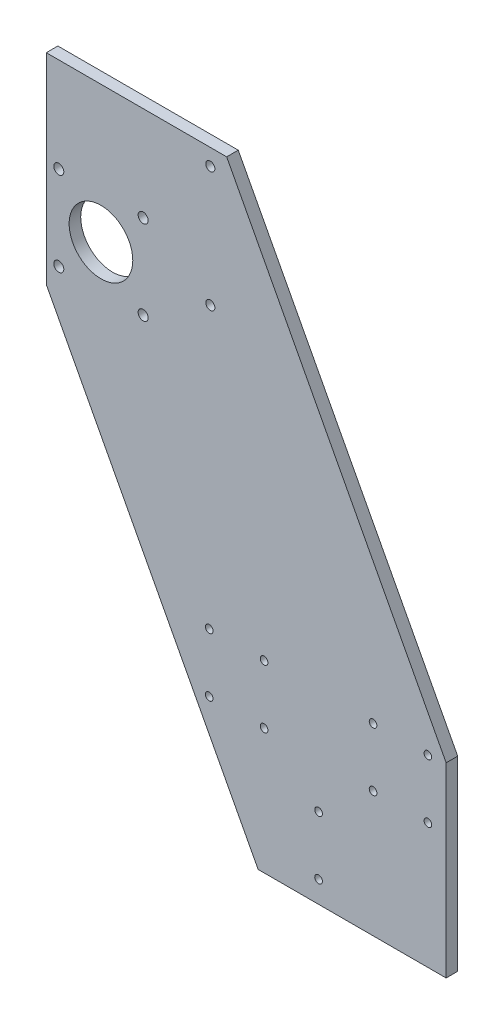
ISO-10303-21;
HEADER;
FILE_DESCRIPTION(('STEP AP214'),'2;1');
FILE_NAME('part.step','',(''),(''),'','','');
FILE_SCHEMA(('AUTOMOTIVE_DESIGN { 1 0 10303 214 1 1 1 1 }'));
ENDSEC;
DATA;
#1=APPLICATION_CONTEXT('core data for automotive mechanical design processes');
#2=APPLICATION_PROTOCOL_DEFINITION('international standard','automotive_design',2000,#1);
#3=PRODUCT_CONTEXT('',#1,'mechanical');
#4=PRODUCT('Part','Part','',(#3));
#5=PRODUCT_RELATED_PRODUCT_CATEGORY('part','',(#4));
#6=PRODUCT_DEFINITION_FORMATION('','',#4);
#7=PRODUCT_DEFINITION_CONTEXT('part definition',#1,'design');
#8=PRODUCT_DEFINITION('design','',#6,#7);
#9=PRODUCT_DEFINITION_SHAPE('','',#8);
#10=(LENGTH_UNIT() NAMED_UNIT(*) SI_UNIT(.MILLI.,.METRE.));
#11=(NAMED_UNIT(*) PLANE_ANGLE_UNIT() SI_UNIT($,.RADIAN.));
#12=(NAMED_UNIT(*) SI_UNIT($,.STERADIAN.) SOLID_ANGLE_UNIT());
#13=UNCERTAINTY_MEASURE_WITH_UNIT(LENGTH_MEASURE(1.E-05),#10,'distance_accuracy_value','');
#14=(GEOMETRIC_REPRESENTATION_CONTEXT(3) GLOBAL_UNCERTAINTY_ASSIGNED_CONTEXT((#13)) GLOBAL_UNIT_ASSIGNED_CONTEXT((#10,
#11,#12)) REPRESENTATION_CONTEXT('',''));
#15=CARTESIAN_POINT('',(0.,0.,0.));
#16=DIRECTION('',(0.,0.,1.));
#17=DIRECTION('',(1.,0.,0.));
#18=AXIS2_PLACEMENT_3D('',#15,#16,#17);
#19=CARTESIAN_POINT('',(0.,0.,6.35));
#20=DIRECTION('',(0.,0.,-1.));
#21=DIRECTION('',(-1.,0.,0.));
#22=AXIS2_PLACEMENT_3D('',#19,#20,#21);
#23=PLANE('',#22);
#24=CARTESIAN_POINT('',(-129.400809698569,301.142486270291,6.35));
#25=DIRECTION('',(0.,0.,1.));
#26=DIRECTION('',(1.,0.,0.));
#27=AXIS2_PLACEMENT_3D('',#24,#25,#26);
#28=CIRCLE('',#27,2.5);
#29=CARTESIAN_POINT('',(-126.900809698569,301.142486270291,6.35));
#30=VERTEX_POINT('',#29);
#31=EDGE_CURVE('E477',#30,#30,#28,.T.);
#32=ORIENTED_EDGE('',*,*,#31,.F.);
#33=EDGE_LOOP('',(#32));
#34=FACE_BOUND('',#33,.T.);
#35=CARTESIAN_POINT('',(-129.400809698569,235.142486270291,6.35));
#36=DIRECTION('',(0.,0.,1.));
#37=DIRECTION('',(1.,0.,0.));
#38=AXIS2_PLACEMENT_3D('',#35,#36,#37);
#39=CIRCLE('',#38,2.5);
#40=CARTESIAN_POINT('',(-126.900809698569,235.142486270291,6.35));
#41=VERTEX_POINT('',#40);
#42=EDGE_CURVE('E478',#41,#41,#39,.T.);
#43=ORIENTED_EDGE('',*,*,#42,.F.);
#44=EDGE_LOOP('',(#43));
#45=FACE_BOUND('',#44,.T.);
#46=CARTESIAN_POINT('',(-189.400809698569,235.142486270291,6.35));
#47=DIRECTION('',(0.,0.,1.));
#48=DIRECTION('',(1.,0.,0.));
#49=AXIS2_PLACEMENT_3D('',#46,#47,#48);
#50=CIRCLE('',#49,17.4625000000001);
#51=CARTESIAN_POINT('',(-171.938309698569,235.142486270291,6.35));
#52=VERTEX_POINT('',#51);
#53=EDGE_CURVE('E481',#52,#52,#50,.T.);
#54=ORIENTED_EDGE('',*,*,#53,.F.);
#55=EDGE_LOOP('',(#54));
#56=FACE_BOUND('',#55,.T.);
#57=CARTESIAN_POINT('',(-166.255809698569,258.287486270291,6.35));
#58=DIRECTION('',(0.,0.,1.));
#59=DIRECTION('',(-1.,0.,0.));
#60=AXIS2_PLACEMENT_3D('',#57,#58,#59);
#61=CIRCLE('',#60,2.75000000000001);
#62=CARTESIAN_POINT('',(-169.005809698569,258.287486270291,6.35));
#63=VERTEX_POINT('',#62);
#64=EDGE_CURVE('E494',#63,#63,#61,.T.);
#65=ORIENTED_EDGE('',*,*,#64,.F.);
#66=EDGE_LOOP('',(#65));
#67=FACE_BOUND('',#66,.T.);
#68=CARTESIAN_POINT('',(-166.255809698569,211.997486270291,6.35));
#69=DIRECTION('',(0.,0.,1.));
#70=DIRECTION('',(1.,0.,0.));
#71=AXIS2_PLACEMENT_3D('',#68,#69,#70);
#72=CIRCLE('',#71,2.75000000000001);
#73=CARTESIAN_POINT('',(-163.505809698569,211.997486270291,6.35));
#74=VERTEX_POINT('',#73);
#75=EDGE_CURVE('E489',#74,#74,#72,.T.);
#76=ORIENTED_EDGE('',*,*,#75,.F.);
#77=EDGE_LOOP('',(#76));
#78=FACE_BOUND('',#77,.T.);
#79=CARTESIAN_POINT('',(-212.545809698569,211.997486270291,6.35));
#80=DIRECTION('',(0.,0.,1.));
#81=DIRECTION('',(-1.,0.,0.));
#82=AXIS2_PLACEMENT_3D('',#79,#80,#81);
#83=CIRCLE('',#82,2.75000000000001);
#84=CARTESIAN_POINT('',(-215.295809698569,211.997486270291,6.35));
#85=VERTEX_POINT('',#84);
#86=EDGE_CURVE('E485',#85,#85,#83,.T.);
#87=ORIENTED_EDGE('',*,*,#86,.F.);
#88=EDGE_LOOP('',(#87));
#89=FACE_BOUND('',#88,.T.);
#90=CARTESIAN_POINT('',(-212.545809698569,258.287486270291,6.35));
#91=DIRECTION('',(0.,0.,1.));
#92=DIRECTION('',(1.,0.,0.));
#93=AXIS2_PLACEMENT_3D('',#90,#91,#92);
#94=CIRCLE('',#93,2.75000000000001);
#95=CARTESIAN_POINT('',(-209.795809698569,258.287486270291,6.35));
#96=VERTEX_POINT('',#95);
#97=EDGE_CURVE('E143',#96,#96,#94,.T.);
#98=ORIENTED_EDGE('',*,*,#97,.F.);
#99=EDGE_LOOP('',(#98));
#100=FACE_BOUND('',#99,.T.);
#101=DIRECTION('',(0.,1.,0.));
#102=VECTOR('',#101,1.);
#103=CARTESIAN_POINT('',(0.,0.,6.35));
#104=LINE('',#103,#102);
#105=CARTESIAN_POINT('',(0.,-19.8575137297087,6.35));
#106=VERTEX_POINT('',#105);
#107=CARTESIAN_POINT('',(0.,82.3898774843441,6.35));
#108=VERTEX_POINT('',#107);
#109=EDGE_CURVE('E91',#106,#108,#104,.T.);
#110=ORIENTED_EDGE('',*,*,#109,.T.);
#111=DIRECTION('',(-0.467423452268308,0.884033549289605,0.));
#112=VECTOR('',#111,1.);
#113=CARTESIAN_POINT('',(0.,82.3898774843441,6.35));
#114=LINE('',#113,#112);
#115=CARTESIAN_POINT('',(-120.421799316766,310.142486270291,6.35));
#116=VERTEX_POINT('',#115);
#117=EDGE_CURVE('E225',#108,#116,#114,.T.);
#118=ORIENTED_EDGE('',*,*,#117,.T.);
#119=DIRECTION('',(-1.,0.,0.));
#120=VECTOR('',#119,1.);
#121=CARTESIAN_POINT('',(-120.421799316766,310.142486270291,6.35));
#122=LINE('',#121,#120);
#123=CARTESIAN_POINT('',(-219.400809698569,310.142486270291,6.35));
#124=VERTEX_POINT('',#123);
#125=EDGE_CURVE('E105',#116,#124,#122,.T.);
#126=ORIENTED_EDGE('',*,*,#125,.T.);
#127=DIRECTION('',(0.,-1.,0.));
#128=VECTOR('',#127,1.);
#129=CARTESIAN_POINT('',(-219.400809698569,200.,6.35));
#130=LINE('',#129,#128);
#131=CARTESIAN_POINT('',(-219.400809698569,200.,6.35));
#132=VERTEX_POINT('',#131);
#133=EDGE_CURVE('E99',#124,#132,#130,.T.);
#134=ORIENTED_EDGE('',*,*,#133,.T.);
#135=DIRECTION('',(0.467423452268308,-0.884033549289605,0.));
#136=VECTOR('',#135,1.);
#137=CARTESIAN_POINT('',(-219.400809698569,200.,6.35));
#138=LINE('',#137,#136);
#139=CARTESIAN_POINT('',(-103.153458953511,-19.8575137297087,6.35));
#140=VERTEX_POINT('',#139);
#141=EDGE_CURVE('E103',#132,#140,#138,.T.);
#142=ORIENTED_EDGE('',*,*,#141,.T.);
#143=DIRECTION('',(1.,0.,0.));
#144=VECTOR('',#143,1.);
#145=CARTESIAN_POINT('',(0.,-19.8575137297087,6.35));
#146=LINE('',#145,#144);
#147=EDGE_CURVE('E55',#140,#106,#146,.T.);
#148=ORIENTED_EDGE('',*,*,#147,.T.);
#149=EDGE_LOOP('',(#110,#118,#126,#134,#142,#148));
#150=FACE_BOUND('',#149,.T.);
#151=CARTESIAN_POINT('',(-130.,81.05,6.35));
#152=DIRECTION('',(0.,0.,1.));
#153=DIRECTION('',(-1.,0.,0.));
#154=AXIS2_PLACEMENT_3D('',#151,#152,#153);
#155=CIRCLE('',#154,2.10000000000002);
#156=CARTESIAN_POINT('',(-132.1,81.05,6.35));
#157=VERTEX_POINT('',#156);
#158=EDGE_CURVE('E125',#157,#157,#155,.T.);
#159=ORIENTED_EDGE('',*,*,#158,.F.);
#160=EDGE_LOOP('',(#159));
#161=FACE_BOUND('',#160,.T.);
#162=CARTESIAN_POINT('',(-40.1,81.05,6.35));
#163=DIRECTION('',(0.,0.,1.));
#164=DIRECTION('',(1.,0.,0.));
#165=AXIS2_PLACEMENT_3D('',#162,#163,#164);
#166=CIRCLE('',#165,2.1);
#167=CARTESIAN_POINT('',(-38.,81.05,6.35));
#168=VERTEX_POINT('',#167);
#169=EDGE_CURVE('E214',#168,#168,#166,.T.);
#170=ORIENTED_EDGE('',*,*,#169,.F.);
#171=EDGE_LOOP('',(#170));
#172=FACE_BOUND('',#171,.T.);
#173=CARTESIAN_POINT('',(-10.,81.05,6.35));
#174=DIRECTION('',(0.,0.,1.));
#175=DIRECTION('',(1.,0.,0.));
#176=AXIS2_PLACEMENT_3D('',#173,#174,#175);
#177=CIRCLE('',#176,2.1);
#178=CARTESIAN_POINT('',(-7.9,81.05,6.35));
#179=VERTEX_POINT('',#178);
#180=EDGE_CURVE('E208',#179,#179,#177,.T.);
#181=ORIENTED_EDGE('',*,*,#180,.F.);
#182=EDGE_LOOP('',(#181));
#183=FACE_BOUND('',#182,.T.);
#184=CARTESIAN_POINT('',(-10.,48.95,6.35));
#185=DIRECTION('',(0.,0.,1.));
#186=DIRECTION('',(-1.,0.,0.));
#187=AXIS2_PLACEMENT_3D('',#184,#185,#186);
#188=CIRCLE('',#187,2.09999999999999);
#189=CARTESIAN_POINT('',(-12.1,48.95,6.35));
#190=VERTEX_POINT('',#189);
#191=EDGE_CURVE('E202',#190,#190,#188,.T.);
#192=ORIENTED_EDGE('',*,*,#191,.F.);
#193=EDGE_LOOP('',(#192));
#194=FACE_BOUND('',#193,.T.);
#195=CARTESIAN_POINT('',(-40.1,48.95,6.35));
#196=DIRECTION('',(0.,0.,1.));
#197=DIRECTION('',(-1.,0.,0.));
#198=AXIS2_PLACEMENT_3D('',#195,#196,#197);
#199=CIRCLE('',#198,2.1);
#200=CARTESIAN_POINT('',(-42.2,48.95,6.35));
#201=VERTEX_POINT('',#200);
#202=EDGE_CURVE('E196',#201,#201,#199,.T.);
#203=ORIENTED_EDGE('',*,*,#202,.F.);
#204=EDGE_LOOP('',(#203));
#205=FACE_BOUND('',#204,.T.);
#206=CARTESIAN_POINT('',(-99.9,81.05,6.35));
#207=DIRECTION('',(0.,0.,1.));
#208=DIRECTION('',(-1.,0.,0.));
#209=AXIS2_PLACEMENT_3D('',#206,#207,#208);
#210=CIRCLE('',#209,2.1);
#211=CARTESIAN_POINT('',(-102.,81.05,6.35));
#212=VERTEX_POINT('',#211);
#213=EDGE_CURVE('E190',#212,#212,#210,.T.);
#214=ORIENTED_EDGE('',*,*,#213,.F.);
#215=EDGE_LOOP('',(#214));
#216=FACE_BOUND('',#215,.T.);
#217=CARTESIAN_POINT('',(-99.9,48.95,6.35));
#218=DIRECTION('',(0.,0.,1.));
#219=DIRECTION('',(1.,0.,0.));
#220=AXIS2_PLACEMENT_3D('',#217,#218,#219);
#221=CIRCLE('',#220,2.09999999999999);
#222=CARTESIAN_POINT('',(-97.8,48.95,6.35));
#223=VERTEX_POINT('',#222);
#224=EDGE_CURVE('E184',#223,#223,#221,.T.);
#225=ORIENTED_EDGE('',*,*,#224,.F.);
#226=EDGE_LOOP('',(#225));
#227=FACE_BOUND('',#226,.T.);
#228=CARTESIAN_POINT('',(-130.,48.95,6.35));
#229=DIRECTION('',(0.,0.,1.));
#230=DIRECTION('',(1.,0.,0.));
#231=AXIS2_PLACEMENT_3D('',#228,#229,#230);
#232=CIRCLE('',#231,2.10000000000002);
#233=CARTESIAN_POINT('',(-127.9,48.95,6.35));
#234=VERTEX_POINT('',#233);
#235=EDGE_CURVE('E178',#234,#234,#232,.T.);
#236=ORIENTED_EDGE('',*,*,#235,.F.);
#237=EDGE_LOOP('',(#236));
#238=FACE_BOUND('',#237,.T.);
#239=CARTESIAN_POINT('',(-70.,24.15,6.35));
#240=DIRECTION('',(0.,0.,1.));
#241=DIRECTION('',(-1.,0.,0.));
#242=AXIS2_PLACEMENT_3D('',#239,#240,#241);
#243=CIRCLE('',#242,2.1);
#244=CARTESIAN_POINT('',(-72.1,24.15,6.35));
#245=VERTEX_POINT('',#244);
#246=EDGE_CURVE('E172',#245,#245,#243,.T.);
#247=ORIENTED_EDGE('',*,*,#246,.F.);
#248=EDGE_LOOP('',(#247));
#249=FACE_BOUND('',#248,.T.);
#250=CARTESIAN_POINT('',(-70.,-7.95000000000001,6.35));
#251=DIRECTION('',(0.,0.,1.));
#252=DIRECTION('',(1.,0.,0.));
#253=AXIS2_PLACEMENT_3D('',#250,#251,#252);
#254=CIRCLE('',#253,2.09999999999999);
#255=CARTESIAN_POINT('',(-67.9,-7.95000000000001,6.35));
#256=VERTEX_POINT('',#255);
#257=EDGE_CURVE('E163',#256,#256,#254,.T.);
#258=ORIENTED_EDGE('',*,*,#257,.F.);
#259=EDGE_LOOP('',(#258));
#260=FACE_BOUND('',#259,.T.);
#261=ADVANCED_FACE('F36',(#34,#45,#56,#67,#78,#89,#100,#150,#161,#172,#183,#194,#205,#216,#227,
#238,#249,#260),#23,.F.);
#262=CARTESIAN_POINT('',(0.,0.,0.));
#263=DIRECTION('',(0.,0.,-1.));
#264=DIRECTION('',(-1.,0.,0.));
#265=AXIS2_PLACEMENT_3D('',#262,#263,#264);
#266=PLANE('',#265);
#267=CARTESIAN_POINT('',(-129.400809698569,301.142486270291,0.));
#268=DIRECTION('',(0.,0.,-1.));
#269=DIRECTION('',(-1.,0.,0.));
#270=AXIS2_PLACEMENT_3D('',#267,#268,#269);
#271=CIRCLE('',#270,2.5);
#272=CARTESIAN_POINT('',(-131.900809698569,301.142486270291,0.));
#273=VERTEX_POINT('',#272);
#274=EDGE_CURVE('E40',#273,#273,#271,.T.);
#275=ORIENTED_EDGE('',*,*,#274,.F.);
#276=EDGE_LOOP('',(#275));
#277=FACE_BOUND('',#276,.T.);
#278=CARTESIAN_POINT('',(-129.400809698569,235.142486270291,0.));
#279=DIRECTION('',(0.,0.,-1.));
#280=DIRECTION('',(-1.,0.,0.));
#281=AXIS2_PLACEMENT_3D('',#278,#279,#280);
#282=CIRCLE('',#281,2.5);
#283=CARTESIAN_POINT('',(-131.900809698569,235.142486270291,0.));
#284=VERTEX_POINT('',#283);
#285=EDGE_CURVE('E154',#284,#284,#282,.T.);
#286=ORIENTED_EDGE('',*,*,#285,.F.);
#287=EDGE_LOOP('',(#286));
#288=FACE_BOUND('',#287,.T.);
#289=CARTESIAN_POINT('',(-189.400809698569,235.142486270291,0.));
#290=DIRECTION('',(0.,0.,-1.));
#291=DIRECTION('',(-1.,0.,0.));
#292=AXIS2_PLACEMENT_3D('',#289,#290,#291);
#293=CIRCLE('',#292,17.4625000000001);
#294=CARTESIAN_POINT('',(-206.863309698569,235.142486270291,0.));
#295=VERTEX_POINT('',#294);
#296=EDGE_CURVE('E152',#295,#295,#293,.T.);
#297=ORIENTED_EDGE('',*,*,#296,.F.);
#298=EDGE_LOOP('',(#297));
#299=FACE_BOUND('',#298,.T.);
#300=CARTESIAN_POINT('',(-166.255809698569,258.287486270291,0.));
#301=DIRECTION('',(0.,0.,-1.));
#302=DIRECTION('',(-1.,0.,0.));
#303=AXIS2_PLACEMENT_3D('',#300,#301,#302);
#304=CIRCLE('',#303,2.75000000000001);
#305=CARTESIAN_POINT('',(-169.005809698569,258.287486270291,0.));
#306=VERTEX_POINT('',#305);
#307=EDGE_CURVE('E149',#306,#306,#304,.T.);
#308=ORIENTED_EDGE('',*,*,#307,.F.);
#309=EDGE_LOOP('',(#308));
#310=FACE_BOUND('',#309,.T.);
#311=CARTESIAN_POINT('',(-166.255809698569,211.997486270291,0.));
#312=DIRECTION('',(0.,0.,-1.));
#313=DIRECTION('',(-1.,0.,0.));
#314=AXIS2_PLACEMENT_3D('',#311,#312,#313);
#315=CIRCLE('',#314,2.75000000000001);
#316=CARTESIAN_POINT('',(-169.005809698569,211.997486270291,0.));
#317=VERTEX_POINT('',#316);
#318=EDGE_CURVE('E146',#317,#317,#315,.T.);
#319=ORIENTED_EDGE('',*,*,#318,.F.);
#320=EDGE_LOOP('',(#319));
#321=FACE_BOUND('',#320,.T.);
#322=CARTESIAN_POINT('',(-212.545809698569,211.997486270291,0.));
#323=DIRECTION('',(0.,0.,-1.));
#324=DIRECTION('',(-1.,0.,0.));
#325=AXIS2_PLACEMENT_3D('',#322,#323,#324);
#326=CIRCLE('',#325,2.75000000000001);
#327=CARTESIAN_POINT('',(-215.295809698569,211.997486270291,0.));
#328=VERTEX_POINT('',#327);
#329=EDGE_CURVE('E142',#328,#328,#326,.T.);
#330=ORIENTED_EDGE('',*,*,#329,.F.);
#331=EDGE_LOOP('',(#330));
#332=FACE_BOUND('',#331,.T.);
#333=CARTESIAN_POINT('',(-212.545809698569,258.287486270291,0.));
#334=DIRECTION('',(0.,0.,-1.));
#335=DIRECTION('',(-1.,0.,0.));
#336=AXIS2_PLACEMENT_3D('',#333,#334,#335);
#337=CIRCLE('',#336,2.75000000000001);
#338=CARTESIAN_POINT('',(-215.295809698569,258.287486270291,0.));
#339=VERTEX_POINT('',#338);
#340=EDGE_CURVE('E139',#339,#339,#337,.T.);
#341=ORIENTED_EDGE('',*,*,#340,.F.);
#342=EDGE_LOOP('',(#341));
#343=FACE_BOUND('',#342,.T.);
#344=CARTESIAN_POINT('',(-70.,24.15,0.));
#345=DIRECTION('',(0.,0.,1.));
#346=DIRECTION('',(-1.,0.,0.));
#347=AXIS2_PLACEMENT_3D('',#344,#345,#346);
#348=CIRCLE('',#347,2.1);
#349=CARTESIAN_POINT('',(-72.1,24.15,0.));
#350=VERTEX_POINT('',#349);
#351=EDGE_CURVE('E168',#350,#350,#348,.T.);
#352=ORIENTED_EDGE('',*,*,#351,.T.);
#353=EDGE_LOOP('',(#352));
#354=FACE_BOUND('',#353,.T.);
#355=CARTESIAN_POINT('',(-99.9,48.95,0.));
#356=DIRECTION('',(0.,0.,1.));
#357=DIRECTION('',(1.,0.,0.));
#358=AXIS2_PLACEMENT_3D('',#355,#356,#357);
#359=CIRCLE('',#358,2.09999999999999);
#360=CARTESIAN_POINT('',(-97.8,48.95,0.));
#361=VERTEX_POINT('',#360);
#362=EDGE_CURVE('E181',#361,#361,#359,.T.);
#363=ORIENTED_EDGE('',*,*,#362,.T.);
#364=EDGE_LOOP('',(#363));
#365=FACE_BOUND('',#364,.T.);
#366=CARTESIAN_POINT('',(-40.1,48.95,0.));
#367=DIRECTION('',(0.,0.,1.));
#368=DIRECTION('',(-1.,0.,0.));
#369=AXIS2_PLACEMENT_3D('',#366,#367,#368);
#370=CIRCLE('',#369,2.1);
#371=CARTESIAN_POINT('',(-42.2,48.95,0.));
#372=VERTEX_POINT('',#371);
#373=EDGE_CURVE('E193',#372,#372,#370,.T.);
#374=ORIENTED_EDGE('',*,*,#373,.T.);
#375=EDGE_LOOP('',(#374));
#376=FACE_BOUND('',#375,.T.);
#377=CARTESIAN_POINT('',(-10.,81.05,0.));
#378=DIRECTION('',(0.,0.,1.));
#379=DIRECTION('',(1.,0.,0.));
#380=AXIS2_PLACEMENT_3D('',#377,#378,#379);
#381=CIRCLE('',#380,2.1);
#382=CARTESIAN_POINT('',(-7.9,81.05,0.));
#383=VERTEX_POINT('',#382);
#384=EDGE_CURVE('E205',#383,#383,#381,.T.);
#385=ORIENTED_EDGE('',*,*,#384,.T.);
#386=EDGE_LOOP('',(#385));
#387=FACE_BOUND('',#386,.T.);
#388=CARTESIAN_POINT('',(-130.,81.05,0.));
#389=DIRECTION('',(0.,0.,1.));
#390=DIRECTION('',(-1.,0.,0.));
#391=AXIS2_PLACEMENT_3D('',#388,#389,#390);
#392=CIRCLE('',#391,2.10000000000002);
#393=CARTESIAN_POINT('',(-132.1,81.05,0.));
#394=VERTEX_POINT('',#393);
#395=EDGE_CURVE('E217',#394,#394,#392,.T.);
#396=ORIENTED_EDGE('',*,*,#395,.T.);
#397=EDGE_LOOP('',(#396));
#398=FACE_BOUND('',#397,.T.);
#399=DIRECTION('',(0.,1.,0.));
#400=VECTOR('',#399,1.);
#401=CARTESIAN_POINT('',(0.,0.,0.));
#402=LINE('',#401,#400);
#403=CARTESIAN_POINT('',(0.,-19.8575137297087,0.));
#404=VERTEX_POINT('',#403);
#405=CARTESIAN_POINT('',(0.,82.3898774843441,0.));
#406=VERTEX_POINT('',#405);
#407=EDGE_CURVE('E85',#404,#406,#402,.T.);
#408=ORIENTED_EDGE('',*,*,#407,.F.);
#409=DIRECTION('',(1.,0.,0.));
#410=VECTOR('',#409,1.);
#411=CARTESIAN_POINT('',(0.,-19.8575137297087,0.));
#412=LINE('',#411,#410);
#413=CARTESIAN_POINT('',(-103.153458953511,-19.8575137297087,0.));
#414=VERTEX_POINT('',#413);
#415=EDGE_CURVE('E131',#414,#404,#412,.T.);
#416=ORIENTED_EDGE('',*,*,#415,.F.);
#417=DIRECTION('',(0.467423452268308,-0.884033549289605,0.));
#418=VECTOR('',#417,1.);
#419=CARTESIAN_POINT('',(-219.400809698569,200.,0.));
#420=LINE('',#419,#418);
#421=CARTESIAN_POINT('',(-219.400809698569,200.,0.));
#422=VERTEX_POINT('',#421);
#423=EDGE_CURVE('E78',#422,#414,#420,.T.);
#424=ORIENTED_EDGE('',*,*,#423,.F.);
#425=DIRECTION('',(0.,-1.,0.));
#426=VECTOR('',#425,1.);
#427=CARTESIAN_POINT('',(-219.400809698569,200.,0.));
#428=LINE('',#427,#426);
#429=CARTESIAN_POINT('',(-219.400809698569,310.142486270291,0.));
#430=VERTEX_POINT('',#429);
#431=EDGE_CURVE('E113',#430,#422,#428,.T.);
#432=ORIENTED_EDGE('',*,*,#431,.F.);
#433=DIRECTION('',(-1.,0.,0.));
#434=VECTOR('',#433,1.);
#435=CARTESIAN_POINT('',(-120.421799316766,310.142486270291,0.));
#436=LINE('',#435,#434);
#437=CARTESIAN_POINT('',(-120.421799316766,310.142486270291,0.));
#438=VERTEX_POINT('',#437);
#439=EDGE_CURVE('E127',#438,#430,#436,.T.);
#440=ORIENTED_EDGE('',*,*,#439,.F.);
#441=DIRECTION('',(-0.467423452268308,0.884033549289605,0.));
#442=VECTOR('',#441,1.);
#443=CARTESIAN_POINT('',(0.,82.3898774843441,0.));
#444=LINE('',#443,#442);
#445=EDGE_CURVE('E124',#406,#438,#444,.T.);
#446=ORIENTED_EDGE('',*,*,#445,.F.);
#447=EDGE_LOOP('',(#408,#416,#424,#432,#440,#446));
#448=FACE_BOUND('',#447,.T.);
#449=CARTESIAN_POINT('',(-40.1,81.05,0.));
#450=DIRECTION('',(0.,0.,1.));
#451=DIRECTION('',(1.,0.,0.));
#452=AXIS2_PLACEMENT_3D('',#449,#450,#451);
#453=CIRCLE('',#452,2.1);
#454=CARTESIAN_POINT('',(-38.,81.05,0.));
#455=VERTEX_POINT('',#454);
#456=EDGE_CURVE('E211',#455,#455,#453,.T.);
#457=ORIENTED_EDGE('',*,*,#456,.T.);
#458=EDGE_LOOP('',(#457));
#459=FACE_BOUND('',#458,.T.);
#460=CARTESIAN_POINT('',(-10.,48.95,0.));
#461=DIRECTION('',(0.,0.,1.));
#462=DIRECTION('',(-1.,0.,0.));
#463=AXIS2_PLACEMENT_3D('',#460,#461,#462);
#464=CIRCLE('',#463,2.09999999999999);
#465=CARTESIAN_POINT('',(-12.1,48.95,0.));
#466=VERTEX_POINT('',#465);
#467=EDGE_CURVE('E199',#466,#466,#464,.T.);
#468=ORIENTED_EDGE('',*,*,#467,.T.);
#469=EDGE_LOOP('',(#468));
#470=FACE_BOUND('',#469,.T.);
#471=CARTESIAN_POINT('',(-99.9,81.05,0.));
#472=DIRECTION('',(0.,0.,1.));
#473=DIRECTION('',(-1.,0.,0.));
#474=AXIS2_PLACEMENT_3D('',#471,#472,#473);
#475=CIRCLE('',#474,2.1);
#476=CARTESIAN_POINT('',(-102.,81.05,0.));
#477=VERTEX_POINT('',#476);
#478=EDGE_CURVE('E187',#477,#477,#475,.T.);
#479=ORIENTED_EDGE('',*,*,#478,.T.);
#480=EDGE_LOOP('',(#479));
#481=FACE_BOUND('',#480,.T.);
#482=CARTESIAN_POINT('',(-130.,48.95,0.));
#483=DIRECTION('',(0.,0.,1.));
#484=DIRECTION('',(1.,0.,0.));
#485=AXIS2_PLACEMENT_3D('',#482,#483,#484);
#486=CIRCLE('',#485,2.10000000000002);
#487=CARTESIAN_POINT('',(-127.9,48.95,0.));
#488=VERTEX_POINT('',#487);
#489=EDGE_CURVE('E175',#488,#488,#486,.T.);
#490=ORIENTED_EDGE('',*,*,#489,.T.);
#491=EDGE_LOOP('',(#490));
#492=FACE_BOUND('',#491,.T.);
#493=CARTESIAN_POINT('',(-70.,-7.95000000000001,0.));
#494=DIRECTION('',(0.,0.,1.));
#495=DIRECTION('',(1.,0.,0.));
#496=AXIS2_PLACEMENT_3D('',#493,#494,#495);
#497=CIRCLE('',#496,2.09999999999999);
#498=CARTESIAN_POINT('',(-67.9,-7.95000000000001,0.));
#499=VERTEX_POINT('',#498);
#500=EDGE_CURVE('E159',#499,#499,#497,.T.);
#501=ORIENTED_EDGE('',*,*,#500,.T.);
#502=EDGE_LOOP('',(#501));
#503=FACE_BOUND('',#502,.T.);
#504=ADVANCED_FACE('F233',(#277,#288,#299,#310,#321,#332,#343,#354,#365,#376,#387,#398,#448,
#459,#470,#481,#492,#503),#266,.T.);
#505=CARTESIAN_POINT('',(0.,0.,6.35));
#506=DIRECTION('',(-1.,0.,0.));
#507=DIRECTION('',(0.,-1.,0.));
#508=AXIS2_PLACEMENT_3D('',#505,#506,#507);
#509=PLANE('',#508);
#510=ORIENTED_EDGE('',*,*,#407,.T.);
#511=DIRECTION('',(0.,0.,-1.));
#512=VECTOR('',#511,1.);
#513=CARTESIAN_POINT('',(0.,82.3898774843441,6.35));
#514=LINE('',#513,#512);
#515=EDGE_CURVE('E11',#108,#406,#514,.T.);
#516=ORIENTED_EDGE('',*,*,#515,.F.);
#517=ORIENTED_EDGE('',*,*,#109,.F.);
#518=DIRECTION('',(0.,0.,-1.));
#519=VECTOR('',#518,1.);
#520=CARTESIAN_POINT('',(0.,-19.8575137297087,6.35));
#521=LINE('',#520,#519);
#522=EDGE_CURVE('E119',#106,#404,#521,.T.);
#523=ORIENTED_EDGE('',*,*,#522,.T.);
#524=EDGE_LOOP('',(#510,#516,#517,#523));
#525=FACE_BOUND('',#524,.T.);
#526=ADVANCED_FACE('F38',(#525),#509,.F.);
#527=CARTESIAN_POINT('',(0.,82.3898774843441,6.35));
#528=DIRECTION('',(-0.884033549289605,-0.467423452268308,0.));
#529=DIRECTION('',(0.467423452268308,-0.884033549289605,0.));
#530=AXIS2_PLACEMENT_3D('',#527,#528,#529);
#531=PLANE('',#530);
#532=ORIENTED_EDGE('',*,*,#445,.T.);
#533=DIRECTION('',(0.,0.,-1.));
#534=VECTOR('',#533,1.);
#535=CARTESIAN_POINT('',(-120.421799316766,310.142486270291,6.35));
#536=LINE('',#535,#534);
#537=EDGE_CURVE('E46',#116,#438,#536,.T.);
#538=ORIENTED_EDGE('',*,*,#537,.F.);
#539=ORIENTED_EDGE('',*,*,#117,.F.);
#540=ORIENTED_EDGE('',*,*,#515,.T.);
#541=EDGE_LOOP('',(#532,#538,#539,#540));
#542=FACE_BOUND('',#541,.T.);
#543=ADVANCED_FACE('F229',(#542),#531,.F.);
#544=CARTESIAN_POINT('',(-120.421799316766,310.142486270291,6.35));
#545=DIRECTION('',(0.,-1.,0.));
#546=DIRECTION('',(0.,0.,-1.));
#547=AXIS2_PLACEMENT_3D('',#544,#545,#546);
#548=PLANE('',#547);
#549=ORIENTED_EDGE('',*,*,#439,.T.);
#550=DIRECTION('',(0.,0.,-1.));
#551=VECTOR('',#550,1.);
#552=CARTESIAN_POINT('',(-219.400809698569,310.142486270291,6.35));
#553=LINE('',#552,#551);
#554=EDGE_CURVE('E114',#124,#430,#553,.T.);
#555=ORIENTED_EDGE('',*,*,#554,.F.);
#556=ORIENTED_EDGE('',*,*,#125,.F.);
#557=ORIENTED_EDGE('',*,*,#537,.T.);
#558=EDGE_LOOP('',(#549,#555,#556,#557));
#559=FACE_BOUND('',#558,.T.);
#560=ADVANCED_FACE('F232',(#559),#548,.F.);
#561=CARTESIAN_POINT('',(-219.400809698569,200.,6.35));
#562=DIRECTION('',(1.,0.,0.));
#563=DIRECTION('',(0.,0.,-1.));
#564=AXIS2_PLACEMENT_3D('',#561,#562,#563);
#565=PLANE('',#564);
#566=ORIENTED_EDGE('',*,*,#431,.T.);
#567=DIRECTION('',(0.,0.,-1.));
#568=VECTOR('',#567,1.);
#569=CARTESIAN_POINT('',(-219.400809698569,200.,6.35));
#570=LINE('',#569,#568);
#571=EDGE_CURVE('E110',#132,#422,#570,.T.);
#572=ORIENTED_EDGE('',*,*,#571,.F.);
#573=ORIENTED_EDGE('',*,*,#133,.F.);
#574=ORIENTED_EDGE('',*,*,#554,.T.);
#575=EDGE_LOOP('',(#566,#572,#573,#574));
#576=FACE_BOUND('',#575,.T.);
#577=ADVANCED_FACE('F111',(#576),#565,.F.);
#578=CARTESIAN_POINT('',(-219.400809698569,200.,6.35));
#579=DIRECTION('',(0.884033549289605,0.467423452268308,0.));
#580=DIRECTION('',(-0.467423452268308,0.884033549289605,0.));
#581=AXIS2_PLACEMENT_3D('',#578,#579,#580);
#582=PLANE('',#581);
#583=ORIENTED_EDGE('',*,*,#423,.T.);
#584=DIRECTION('',(0.,0.,-1.));
#585=VECTOR('',#584,1.);
#586=CARTESIAN_POINT('',(-103.153458953511,-19.8575137297087,6.35));
#587=LINE('',#586,#585);
#588=EDGE_CURVE('E115',#140,#414,#587,.T.);
#589=ORIENTED_EDGE('',*,*,#588,.F.);
#590=ORIENTED_EDGE('',*,*,#141,.F.);
#591=ORIENTED_EDGE('',*,*,#571,.T.);
#592=EDGE_LOOP('',(#583,#589,#590,#591));
#593=FACE_BOUND('',#592,.T.);
#594=ADVANCED_FACE('F117',(#593),#582,.F.);
#595=CARTESIAN_POINT('',(0.,-19.8575137297087,6.35));
#596=DIRECTION('',(0.,1.,0.));
#597=DIRECTION('',(-1.,0.,0.));
#598=AXIS2_PLACEMENT_3D('',#595,#596,#597);
#599=PLANE('',#598);
#600=ORIENTED_EDGE('',*,*,#415,.T.);
#601=ORIENTED_EDGE('',*,*,#522,.F.);
#602=ORIENTED_EDGE('',*,*,#147,.F.);
#603=ORIENTED_EDGE('',*,*,#588,.T.);
#604=EDGE_LOOP('',(#600,#601,#602,#603));
#605=FACE_BOUND('',#604,.T.);
#606=ADVANCED_FACE('F236',(#605),#599,.F.);
#607=CARTESIAN_POINT('',(-130.,81.05,6.35));
#608=DIRECTION('',(0.,0.,-1.));
#609=DIRECTION('',(-1.,0.,0.));
#610=AXIS2_PLACEMENT_3D('',#607,#608,#609);
#611=CYLINDRICAL_SURFACE('',#610,2.10000000000002);
#612=ORIENTED_EDGE('',*,*,#158,.T.);
#613=EDGE_LOOP('',(#612));
#614=FACE_BOUND('',#613,.T.);
#615=ORIENTED_EDGE('',*,*,#395,.F.);
#616=EDGE_LOOP('',(#615));
#617=FACE_BOUND('',#616,.T.);
#618=ADVANCED_FACE('F253',(#614,#617),#611,.F.);
#619=CARTESIAN_POINT('',(-40.1,81.05,6.35));
#620=DIRECTION('',(0.,0.,-1.));
#621=DIRECTION('',(-1.,0.,0.));
#622=AXIS2_PLACEMENT_3D('',#619,#620,#621);
#623=CYLINDRICAL_SURFACE('',#622,2.1);
#624=ORIENTED_EDGE('',*,*,#169,.T.);
#625=EDGE_LOOP('',(#624));
#626=FACE_BOUND('',#625,.T.);
#627=ORIENTED_EDGE('',*,*,#456,.F.);
#628=EDGE_LOOP('',(#627));
#629=FACE_BOUND('',#628,.T.);
#630=ADVANCED_FACE('F285',(#626,#629),#623,.F.);
#631=CARTESIAN_POINT('',(-10.,81.05,6.35));
#632=DIRECTION('',(0.,0.,-1.));
#633=DIRECTION('',(-1.,0.,0.));
#634=AXIS2_PLACEMENT_3D('',#631,#632,#633);
#635=CYLINDRICAL_SURFACE('',#634,2.1);
#636=ORIENTED_EDGE('',*,*,#180,.T.);
#637=EDGE_LOOP('',(#636));
#638=FACE_BOUND('',#637,.T.);
#639=ORIENTED_EDGE('',*,*,#384,.F.);
#640=EDGE_LOOP('',(#639));
#641=FACE_BOUND('',#640,.T.);
#642=ADVANCED_FACE('F292',(#638,#641),#635,.F.);
#643=CARTESIAN_POINT('',(-10.,48.95,6.35));
#644=DIRECTION('',(0.,0.,-1.));
#645=DIRECTION('',(-1.,0.,0.));
#646=AXIS2_PLACEMENT_3D('',#643,#644,#645);
#647=CYLINDRICAL_SURFACE('',#646,2.09999999999999);
#648=ORIENTED_EDGE('',*,*,#191,.T.);
#649=EDGE_LOOP('',(#648));
#650=FACE_BOUND('',#649,.T.);
#651=ORIENTED_EDGE('',*,*,#467,.F.);
#652=EDGE_LOOP('',(#651));
#653=FACE_BOUND('',#652,.T.);
#654=ADVANCED_FACE('F299',(#650,#653),#647,.F.);
#655=CARTESIAN_POINT('',(-40.1,48.95,6.35));
#656=DIRECTION('',(0.,0.,-1.));
#657=DIRECTION('',(-1.,0.,0.));
#658=AXIS2_PLACEMENT_3D('',#655,#656,#657);
#659=CYLINDRICAL_SURFACE('',#658,2.1);
#660=ORIENTED_EDGE('',*,*,#202,.T.);
#661=EDGE_LOOP('',(#660));
#662=FACE_BOUND('',#661,.T.);
#663=ORIENTED_EDGE('',*,*,#373,.F.);
#664=EDGE_LOOP('',(#663));
#665=FACE_BOUND('',#664,.T.);
#666=ADVANCED_FACE('F307',(#662,#665),#659,.F.);
#667=CARTESIAN_POINT('',(-99.9,81.05,6.35));
#668=DIRECTION('',(0.,0.,-1.));
#669=DIRECTION('',(-1.,0.,0.));
#670=AXIS2_PLACEMENT_3D('',#667,#668,#669);
#671=CYLINDRICAL_SURFACE('',#670,2.1);
#672=ORIENTED_EDGE('',*,*,#213,.T.);
#673=EDGE_LOOP('',(#672));
#674=FACE_BOUND('',#673,.T.);
#675=ORIENTED_EDGE('',*,*,#478,.F.);
#676=EDGE_LOOP('',(#675));
#677=FACE_BOUND('',#676,.T.);
#678=ADVANCED_FACE('F315',(#674,#677),#671,.F.);
#679=CARTESIAN_POINT('',(-99.9,48.95,6.35));
#680=DIRECTION('',(0.,0.,-1.));
#681=DIRECTION('',(-1.,0.,0.));
#682=AXIS2_PLACEMENT_3D('',#679,#680,#681);
#683=CYLINDRICAL_SURFACE('',#682,2.09999999999999);
#684=ORIENTED_EDGE('',*,*,#224,.T.);
#685=EDGE_LOOP('',(#684));
#686=FACE_BOUND('',#685,.T.);
#687=ORIENTED_EDGE('',*,*,#362,.F.);
#688=EDGE_LOOP('',(#687));
#689=FACE_BOUND('',#688,.T.);
#690=ADVANCED_FACE('F323',(#686,#689),#683,.F.);
#691=CARTESIAN_POINT('',(-130.,48.95,6.35));
#692=DIRECTION('',(0.,0.,-1.));
#693=DIRECTION('',(-1.,0.,0.));
#694=AXIS2_PLACEMENT_3D('',#691,#692,#693);
#695=CYLINDRICAL_SURFACE('',#694,2.10000000000002);
#696=ORIENTED_EDGE('',*,*,#235,.T.);
#697=EDGE_LOOP('',(#696));
#698=FACE_BOUND('',#697,.T.);
#699=ORIENTED_EDGE('',*,*,#489,.F.);
#700=EDGE_LOOP('',(#699));
#701=FACE_BOUND('',#700,.T.);
#702=ADVANCED_FACE('F331',(#698,#701),#695,.F.);
#703=CARTESIAN_POINT('',(-70.,24.15,6.35));
#704=DIRECTION('',(0.,0.,-1.));
#705=DIRECTION('',(-1.,0.,0.));
#706=AXIS2_PLACEMENT_3D('',#703,#704,#705);
#707=CYLINDRICAL_SURFACE('',#706,2.1);
#708=ORIENTED_EDGE('',*,*,#246,.T.);
#709=EDGE_LOOP('',(#708));
#710=FACE_BOUND('',#709,.T.);
#711=ORIENTED_EDGE('',*,*,#351,.F.);
#712=EDGE_LOOP('',(#711));
#713=FACE_BOUND('',#712,.T.);
#714=ADVANCED_FACE('F339',(#710,#713),#707,.F.);
#715=CARTESIAN_POINT('',(-70.,-7.95000000000001,6.35));
#716=DIRECTION('',(0.,0.,-1.));
#717=DIRECTION('',(-1.,0.,0.));
#718=AXIS2_PLACEMENT_3D('',#715,#716,#717);
#719=CYLINDRICAL_SURFACE('',#718,2.09999999999999);
#720=ORIENTED_EDGE('',*,*,#257,.T.);
#721=EDGE_LOOP('',(#720));
#722=FACE_BOUND('',#721,.T.);
#723=ORIENTED_EDGE('',*,*,#500,.F.);
#724=EDGE_LOOP('',(#723));
#725=FACE_BOUND('',#724,.T.);
#726=ADVANCED_FACE('F347',(#722,#725),#719,.F.);
#727=CARTESIAN_POINT('',(-212.545809698569,258.287486270291,-6.35));
#728=DIRECTION('',(0.,0.,1.));
#729=DIRECTION('',(1.,0.,0.));
#730=AXIS2_PLACEMENT_3D('',#727,#728,#729);
#731=CYLINDRICAL_SURFACE('',#730,2.75000000000001);
#732=ORIENTED_EDGE('',*,*,#340,.T.);
#733=EDGE_LOOP('',(#732));
#734=FACE_BOUND('',#733,.T.);
#735=ORIENTED_EDGE('',*,*,#97,.T.);
#736=EDGE_LOOP('',(#735));
#737=FACE_BOUND('',#736,.T.);
#738=ADVANCED_FACE('F355',(#734,#737),#731,.F.);
#739=CARTESIAN_POINT('',(-212.545809698569,211.997486270291,-6.35));
#740=DIRECTION('',(0.,0.,1.));
#741=DIRECTION('',(1.,0.,0.));
#742=AXIS2_PLACEMENT_3D('',#739,#740,#741);
#743=CYLINDRICAL_SURFACE('',#742,2.75000000000001);
#744=ORIENTED_EDGE('',*,*,#329,.T.);
#745=EDGE_LOOP('',(#744));
#746=FACE_BOUND('',#745,.T.);
#747=ORIENTED_EDGE('',*,*,#86,.T.);
#748=EDGE_LOOP('',(#747));
#749=FACE_BOUND('',#748,.T.);
#750=ADVANCED_FACE('F363',(#746,#749),#743,.F.);
#751=CARTESIAN_POINT('',(-166.255809698569,211.997486270291,-6.35));
#752=DIRECTION('',(0.,0.,1.));
#753=DIRECTION('',(1.,0.,0.));
#754=AXIS2_PLACEMENT_3D('',#751,#752,#753);
#755=CYLINDRICAL_SURFACE('',#754,2.75000000000001);
#756=ORIENTED_EDGE('',*,*,#318,.T.);
#757=EDGE_LOOP('',(#756));
#758=FACE_BOUND('',#757,.T.);
#759=ORIENTED_EDGE('',*,*,#75,.T.);
#760=EDGE_LOOP('',(#759));
#761=FACE_BOUND('',#760,.T.);
#762=ADVANCED_FACE('F372',(#758,#761),#755,.F.);
#763=CARTESIAN_POINT('',(-166.255809698569,258.287486270291,-6.35));
#764=DIRECTION('',(0.,0.,1.));
#765=DIRECTION('',(1.,0.,0.));
#766=AXIS2_PLACEMENT_3D('',#763,#764,#765);
#767=CYLINDRICAL_SURFACE('',#766,2.75000000000001);
#768=ORIENTED_EDGE('',*,*,#307,.T.);
#769=EDGE_LOOP('',(#768));
#770=FACE_BOUND('',#769,.T.);
#771=ORIENTED_EDGE('',*,*,#64,.T.);
#772=EDGE_LOOP('',(#771));
#773=FACE_BOUND('',#772,.T.);
#774=ADVANCED_FACE('F380',(#770,#773),#767,.F.);
#775=CARTESIAN_POINT('',(-189.400809698569,235.142486270291,-6.35));
#776=DIRECTION('',(0.,0.,1.));
#777=DIRECTION('',(1.,0.,0.));
#778=AXIS2_PLACEMENT_3D('',#775,#776,#777);
#779=CYLINDRICAL_SURFACE('',#778,17.4625000000001);
#780=ORIENTED_EDGE('',*,*,#296,.T.);
#781=EDGE_LOOP('',(#780));
#782=FACE_BOUND('',#781,.T.);
#783=ORIENTED_EDGE('',*,*,#53,.T.);
#784=EDGE_LOOP('',(#783));
#785=FACE_BOUND('',#784,.T.);
#786=ADVANCED_FACE('F388',(#782,#785),#779,.F.);
#787=CARTESIAN_POINT('',(-129.400809698569,235.142486270291,-6.35));
#788=DIRECTION('',(0.,0.,1.));
#789=DIRECTION('',(1.,0.,0.));
#790=AXIS2_PLACEMENT_3D('',#787,#788,#789);
#791=CYLINDRICAL_SURFACE('',#790,2.5);
#792=ORIENTED_EDGE('',*,*,#285,.T.);
#793=EDGE_LOOP('',(#792));
#794=FACE_BOUND('',#793,.T.);
#795=ORIENTED_EDGE('',*,*,#42,.T.);
#796=EDGE_LOOP('',(#795));
#797=FACE_BOUND('',#796,.T.);
#798=ADVANCED_FACE('F396',(#794,#797),#791,.F.);
#799=CARTESIAN_POINT('',(-129.400809698569,301.142486270291,-6.35));
#800=DIRECTION('',(0.,0.,1.));
#801=DIRECTION('',(1.,0.,0.));
#802=AXIS2_PLACEMENT_3D('',#799,#800,#801);
#803=CYLINDRICAL_SURFACE('',#802,2.5);
#804=ORIENTED_EDGE('',*,*,#274,.T.);
#805=EDGE_LOOP('',(#804));
#806=FACE_BOUND('',#805,.T.);
#807=ORIENTED_EDGE('',*,*,#31,.T.);
#808=EDGE_LOOP('',(#807));
#809=FACE_BOUND('',#808,.T.);
#810=ADVANCED_FACE('F404',(#806,#809),#803,.F.);
#811=CLOSED_SHELL('',(#261,#504,#526,#543,#560,#577,#594,#606,#618,#630,#642,#654,#666,#678,
#690,#702,#714,#726,#738,#750,#762,#774,#786,#798,#810));
#812=MANIFOLD_SOLID_BREP('B2',#811);
#813=ADVANCED_BREP_SHAPE_REPRESENTATION('',(#18,#812),#14);
#814=SHAPE_DEFINITION_REPRESENTATION(#9,#813);
ENDSEC;
END-ISO-10303-21;
